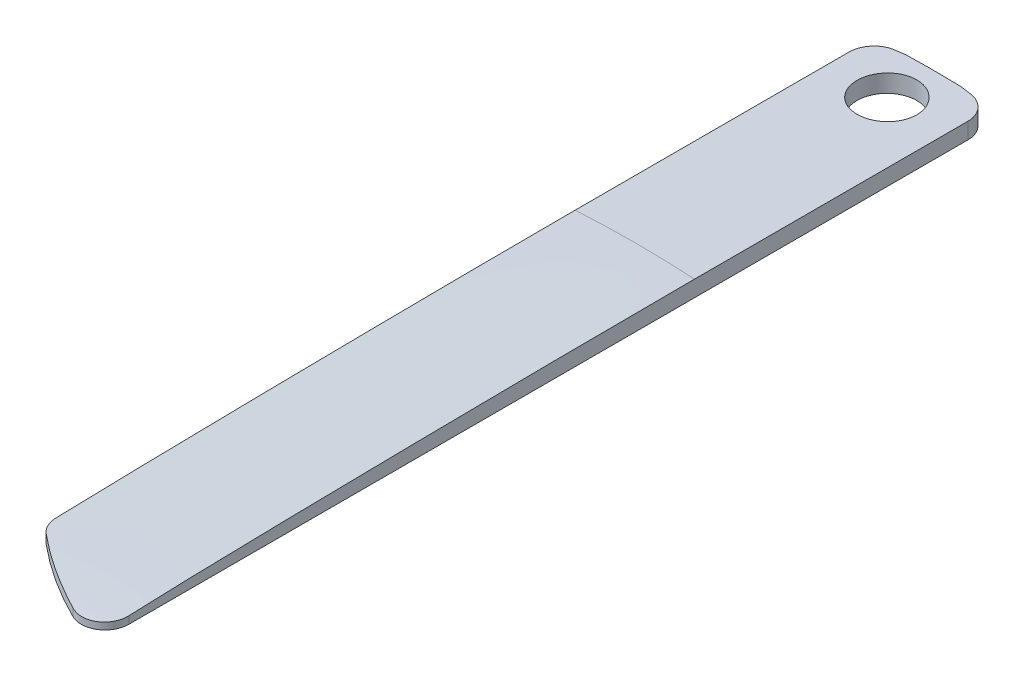
ISO-10303-21;
HEADER;
FILE_DESCRIPTION(('STEP AP214'),'2;1');
FILE_NAME('part.step','',(''),(''),'','','');
FILE_SCHEMA(('AUTOMOTIVE_DESIGN { 1 0 10303 214 1 1 1 1 }'));
ENDSEC;
DATA;
#1=APPLICATION_CONTEXT('core data for automotive mechanical design processes');
#2=APPLICATION_PROTOCOL_DEFINITION('international standard','automotive_design',2000,#1);
#3=PRODUCT_CONTEXT('',#1,'mechanical');
#4=PRODUCT('Part','Part','',(#3));
#5=PRODUCT_RELATED_PRODUCT_CATEGORY('part','',(#4));
#6=PRODUCT_DEFINITION_FORMATION('','',#4);
#7=PRODUCT_DEFINITION_CONTEXT('part definition',#1,'design');
#8=PRODUCT_DEFINITION('design','',#6,#7);
#9=PRODUCT_DEFINITION_SHAPE('','',#8);
#10=(LENGTH_UNIT() NAMED_UNIT(*) SI_UNIT(.MILLI.,.METRE.));
#11=(NAMED_UNIT(*) PLANE_ANGLE_UNIT() SI_UNIT($,.RADIAN.));
#12=(NAMED_UNIT(*) SI_UNIT($,.STERADIAN.) SOLID_ANGLE_UNIT());
#13=UNCERTAINTY_MEASURE_WITH_UNIT(LENGTH_MEASURE(1.E-05),#10,'distance_accuracy_value','');
#14=(GEOMETRIC_REPRESENTATION_CONTEXT(3) GLOBAL_UNCERTAINTY_ASSIGNED_CONTEXT((#13)) GLOBAL_UNIT_ASSIGNED_CONTEXT((#10,
#11,#12)) REPRESENTATION_CONTEXT('',''));
#15=CARTESIAN_POINT('',(0.,0.,0.));
#16=DIRECTION('',(0.,0.,1.));
#17=DIRECTION('',(1.,0.,0.));
#18=AXIS2_PLACEMENT_3D('',#15,#16,#17);
#19=CARTESIAN_POINT('',(-5.,1.,0.));
#20=DIRECTION('',(0.,1.,0.));
#21=DIRECTION('',(0.,0.,1.));
#22=AXIS2_PLACEMENT_3D('',#19,#20,#21);
#23=PLANE('',#22);
#24=CARTESIAN_POINT('',(3.00000000000001,1.,47.4704140906356));
#25=DIRECTION('',(0.,1.,0.));
#26=DIRECTION('',(0.,0.,1.));
#27=AXIS2_PLACEMENT_3D('',#24,#25,#26);
#28=CIRCLE('',#27,2.);
#29=CARTESIAN_POINT('',(5.00000000000001,1.,47.4704140906356));
#30=VERTEX_POINT('',#29);
#31=CARTESIAN_POINT('',(2.12078459872326,1.,49.2667938606614));
#32=VERTEX_POINT('',#31);
#33=EDGE_CURVE('E135',#30,#32,#28,.F.);
#34=ORIENTED_EDGE('',*,*,#33,.T.);
#35=CARTESIAN_POINT('',(16.1882310191513,1.,20.5247175402494));
#36=DIRECTION('',(0.,1.,0.));
#37=DIRECTION('',(0.,0.,1.));
#38=AXIS2_PLACEMENT_3D('',#35,#36,#37);
#39=CIRCLE('',#38,32.);
#40=CARTESIAN_POINT('',(-4.27921540127676,1.,45.123165398334));
#41=VERTEX_POINT('',#40);
#42=EDGE_CURVE('E137',#41,#32,#39,.T.);
#43=ORIENTED_EDGE('',*,*,#42,.F.);
#44=CARTESIAN_POINT('',(-3.00000000000001,1.,43.5857624072037));
#45=DIRECTION('',(0.,1.,0.));
#46=DIRECTION('',(0.,0.,1.));
#47=AXIS2_PLACEMENT_3D('',#44,#45,#46);
#48=CIRCLE('',#47,2.);
#49=CARTESIAN_POINT('',(-5.00000000000001,1.,43.5857624072037));
#50=VERTEX_POINT('',#49);
#51=EDGE_CURVE('E49',#41,#50,#48,.F.);
#52=ORIENTED_EDGE('',*,*,#51,.T.);
#53=DIRECTION('',(0.,0.,1.));
#54=VECTOR('',#53,1.);
#55=CARTESIAN_POINT('',(-5.,1.,-24.8932111423819));
#56=LINE('',#55,#54);
#57=CARTESIAN_POINT('',(-5.,1.,-22.8035085019828));
#58=VERTEX_POINT('',#57);
#59=EDGE_CURVE('E55',#58,#50,#56,.T.);
#60=ORIENTED_EDGE('',*,*,#59,.F.);
#61=CARTESIAN_POINT('',(-3.,1.,-22.8035085019828));
#62=DIRECTION('',(0.,1.,0.));
#63=DIRECTION('',(0.,0.,1.));
#64=AXIS2_PLACEMENT_3D('',#61,#62,#63);
#65=CIRCLE('',#64,2.);
#66=CARTESIAN_POINT('',(-3.26086956521739,1.,-24.7864222847639));
#67=VERTEX_POINT('',#66);
#68=EDGE_CURVE('E207',#58,#67,#65,.F.);
#69=ORIENTED_EDGE('',*,*,#68,.T.);
#70=CARTESIAN_POINT('',(0.,1.,0.));
#71=DIRECTION('',(0.,1.,0.));
#72=DIRECTION('',(0.,0.,1.));
#73=AXIS2_PLACEMENT_3D('',#70,#71,#72);
#74=CIRCLE('',#73,25.);
#75=CARTESIAN_POINT('',(-2.30825453986155,1.,-24.8932111423819));
#76=VERTEX_POINT('',#75);
#77=EDGE_CURVE('E210',#76,#67,#74,.T.);
#78=ORIENTED_EDGE('',*,*,#77,.F.);
#79=DIRECTION('',(1.,0.,0.));
#80=VECTOR('',#79,1.);
#81=CARTESIAN_POINT('',(0.,1.,-24.8932111423819));
#82=LINE('',#81,#80);
#83=CARTESIAN_POINT('',(2.30825453986164,1.,-24.8932111423819));
#84=VERTEX_POINT('',#83);
#85=EDGE_CURVE('E143',#76,#84,#82,.T.);
#86=ORIENTED_EDGE('',*,*,#85,.T.);
#87=CARTESIAN_POINT('',(0.,1.,0.));
#88=DIRECTION('',(0.,1.,0.));
#89=DIRECTION('',(0.,0.,1.));
#90=AXIS2_PLACEMENT_3D('',#87,#88,#89);
#91=CIRCLE('',#90,25.);
#92=CARTESIAN_POINT('',(3.26086956521739,1.,-24.7864222847639));
#93=VERTEX_POINT('',#92);
#94=EDGE_CURVE('E203',#93,#84,#91,.T.);
#95=ORIENTED_EDGE('',*,*,#94,.F.);
#96=CARTESIAN_POINT('',(3.,1.,-22.8035085019828));
#97=DIRECTION('',(0.,1.,0.));
#98=DIRECTION('',(0.,0.,1.));
#99=AXIS2_PLACEMENT_3D('',#96,#97,#98);
#100=CIRCLE('',#99,2.);
#101=CARTESIAN_POINT('',(5.,1.,-22.8035085019828));
#102=VERTEX_POINT('',#101);
#103=EDGE_CURVE('E68',#93,#102,#100,.F.);
#104=ORIENTED_EDGE('',*,*,#103,.T.);
#105=DIRECTION('',(0.,0.,1.));
#106=VECTOR('',#105,1.);
#107=CARTESIAN_POINT('',(5.,1.,-24.8932111423819));
#108=LINE('',#107,#106);
#109=EDGE_CURVE('E11',#102,#30,#108,.T.);
#110=ORIENTED_EDGE('',*,*,#109,.T.);
#111=EDGE_LOOP('',(#34,#43,#52,#60,#69,#78,#86,#95,#104,#110));
#112=FACE_BOUND('',#111,.T.);
#113=CARTESIAN_POINT('',(0.,1.,-21.));
#114=DIRECTION('',(0.,1.,0.));
#115=DIRECTION('',(0.,0.,1.));
#116=AXIS2_PLACEMENT_3D('',#113,#114,#115);
#117=CIRCLE('',#116,2.5);
#118=CARTESIAN_POINT('',(0.,1.,-18.5));
#119=VERTEX_POINT('',#118);
#120=EDGE_CURVE('E214',#119,#119,#117,.T.);
#121=ORIENTED_EDGE('',*,*,#120,.T.);
#122=EDGE_LOOP('',(#121));
#123=FACE_BOUND('',#122,.T.);
#124=ADVANCED_FACE('F44',(#112,#123),#23,.F.);
#125=CARTESIAN_POINT('',(16.1882310191513,2.5,20.5247175402494));
#126=DIRECTION('',(0.,-1.,0.));
#127=DIRECTION('',(0.,0.,-1.));
#128=AXIS2_PLACEMENT_3D('',#125,#126,#127);
#129=CYLINDRICAL_SURFACE('',#128,32.);
#130=DIRECTION('',(0.,-1.,0.));
#131=VECTOR('',#130,1.);
#132=CARTESIAN_POINT('',(-4.27921540127676,2.5,45.123165398334));
#133=LINE('',#132,#131);
#134=CARTESIAN_POINT('',(-4.27921540127676,1.75836287009214,45.123165398334));
#135=VERTEX_POINT('',#134);
#136=EDGE_CURVE('E132',#135,#41,#133,.T.);
#137=ORIENTED_EDGE('',*,*,#136,.T.);
#138=ORIENTED_EDGE('',*,*,#42,.T.);
#139=DIRECTION('',(0.,-1.,0.));
#140=VECTOR('',#139,1.);
#141=CARTESIAN_POINT('',(2.12078459872326,2.5,49.2667938606614));
#142=LINE('',#141,#140);
#143=CARTESIAN_POINT('',(2.12078459872327,1.63257861555496,49.2667938606614));
#144=VERTEX_POINT('',#143);
#145=EDGE_CURVE('E151',#32,#144,#142,.F.);
#146=ORIENTED_EDGE('',*,*,#145,.T.);
#147=CARTESIAN_POINT('',(-4.27921540127676,1.75836287009214,45.123165398334));
#148=CARTESIAN_POINT('',(-3.95180063333138,1.76567310399807,45.3956029963143));
#149=CARTESIAN_POINT('',(-3.6189100957035,1.7712082310094,45.6615179891268));
#150=CARTESIAN_POINT('',(-2.9424502332957,1.7782078956104,46.180101423668));
#151=CARTESIAN_POINT('',(-2.59887157709789,1.77966876917331,46.4327577415204));
#152=CARTESIAN_POINT('',(-1.90175868338306,1.77798418083318,46.9242299833483));
#153=CARTESIAN_POINT('',(-1.5482204929,1.77483686392632,47.1630402934475));
#154=CARTESIAN_POINT('',(-0.834923897698562,1.76335921879306,47.6243680845399));
#155=CARTESIAN_POINT('',(-0.475242358582847,1.7550725077941,47.8470052412647));
#156=CARTESIAN_POINT('',(0.0704919604790495,1.7381455849348,48.170027612442));
#157=CARTESIAN_POINT('',(0.2534100725439,1.73175513213823,48.2758640431516));
#158=CARTESIAN_POINT('',(0.621265083615057,1.71731070992492,48.4838701141943));
#159=CARTESIAN_POINT('',(0.806202029431081,1.7092567018582,48.5860396692688));
#160=CARTESIAN_POINT('',(1.17789385960771,1.69124390139991,48.786606255942));
#161=CARTESIAN_POINT('',(1.36464776137014,1.68128608954571,48.8850051983797));
#162=CARTESIAN_POINT('',(1.73995078950827,1.65904865967811,49.078031138539));
#163=CARTESIAN_POINT('',(1.92849978946269,1.64676920403645,49.1726583994853));
#164=CARTESIAN_POINT('',(2.11883357763895,1.63272272954681,49.265838896476));
#165=CARTESIAN_POINT('',(2.11980907744889,1.63265069507864,49.2663164041053));
#166=CARTESIAN_POINT('',(2.12078459872327,1.63257861555496,49.2667938606614));
#167=B_SPLINE_CURVE_WITH_KNOTS('',3,(#147,#148,#149,#150,#151,#152,#153,#154,#155,#156,#157,
#158,#159,#160,#161,#162,#163,#164,#165,#166),.UNSPECIFIED.,.F.,.F.,(4,2,2,2,2,2,2,2,2,4),(0.,
1.27792287035641,2.55699462261817,3.83658140033607,5.1054543875391,5.73969546087214,
6.37395127141278,7.00788128983442,7.64176698868261,7.64503244751067),.UNSPECIFIED.);
#168=EDGE_CURVE('E148',#135,#144,#167,.T.);
#169=ORIENTED_EDGE('',*,*,#168,.F.);
#170=EDGE_LOOP('',(#137,#138,#146,#169));
#171=FACE_BOUND('',#170,.T.);
#172=ADVANCED_FACE('F146',(#171),#129,.T.);
#173=CARTESIAN_POINT('',(0.,2.5,0.));
#174=DIRECTION('',(0.,-1.,0.));
#175=DIRECTION('',(0.,0.,-1.));
#176=AXIS2_PLACEMENT_3D('',#173,#174,#175);
#177=CYLINDRICAL_SURFACE('',#176,25.);
#178=DIRECTION('',(0.,-1.,0.));
#179=VECTOR('',#178,1.);
#180=CARTESIAN_POINT('',(3.26086956521739,2.5,-24.7864222847639));
#181=LINE('',#180,#179);
#182=CARTESIAN_POINT('',(3.26086956521739,2.43742832037382,-24.7864222847639));
#183=VERTEX_POINT('',#182);
#184=EDGE_CURVE('E187',#183,#93,#181,.T.);
#185=ORIENTED_EDGE('',*,*,#184,.T.);
#186=ORIENTED_EDGE('',*,*,#94,.T.);
#187=DIRECTION('',(0.,-1.,0.));
#188=VECTOR('',#187,1.);
#189=CARTESIAN_POINT('',(2.30825453986155,2.5,-24.8932111423819));
#190=LINE('',#189,#188);
#191=CARTESIAN_POINT('',(2.30825453986164,2.46865281372424,-24.8932111423819));
#192=VERTEX_POINT('',#191);
#193=EDGE_CURVE('E168',#192,#84,#190,.T.);
#194=ORIENTED_EDGE('',*,*,#193,.F.);
#195=CARTESIAN_POINT('',(3.26086956521738,2.43742832037382,-24.7864222847639));
#196=CARTESIAN_POINT('',(3.10247009935233,2.44351140642509,-24.807261382743));
#197=CARTESIAN_POINT('',(2.94388578097348,2.44915499056326,-24.8265800032007));
#198=CARTESIAN_POINT('',(2.62634743918824,2.4595631550134,-24.8621762890734));
#199=CARTESIAN_POINT('',(2.46739341578183,2.46432773532537,-24.8784539544883));
#200=CARTESIAN_POINT('',(2.30825453986164,2.46865281372423,-24.8932111423819));
#201=B_SPLINE_CURVE_WITH_KNOTS('',3,(#195,#196,#197,#198,#199,#200),.UNSPECIFIED.,.F.,.F.,(4,2,
4),(0.,0.479568979987204,0.959137959974391),.UNSPECIFIED.);
#202=EDGE_CURVE('E320',#183,#192,#201,.T.);
#203=ORIENTED_EDGE('',*,*,#202,.F.);
#204=EDGE_LOOP('',(#185,#186,#194,#203));
#205=FACE_BOUND('',#204,.T.);
#206=ADVANCED_FACE('F287',(#205),#177,.T.);
#207=CARTESIAN_POINT('',(-3.,2.5,-22.8035085019828));
#208=DIRECTION('',(0.,-1.,0.));
#209=DIRECTION('',(0.,0.,-1.));
#210=AXIS2_PLACEMENT_3D('',#207,#208,#209);
#211=CYLINDRICAL_SURFACE('',#210,2.);
#212=ORIENTED_EDGE('',*,*,#68,.F.);
#213=DIRECTION('',(0.,-1.,0.));
#214=VECTOR('',#213,1.);
#215=CARTESIAN_POINT('',(-5.,2.5,-22.8035085019828));
#216=LINE('',#215,#214);
#217=CARTESIAN_POINT('',(-5.,2.3528137423857,-22.8035085019828));
#218=VERTEX_POINT('',#217);
#219=EDGE_CURVE('E158',#218,#58,#216,.T.);
#220=ORIENTED_EDGE('',*,*,#219,.F.);
#221=CARTESIAN_POINT('',(-5.,2.3528137423857,-22.8035085019828));
#222=CARTESIAN_POINT('',(-4.99999967769444,2.35281343915907,-22.8597131711831));
#223=CARTESIAN_POINT('',(-4.99762928565556,2.35295347418442,-22.9158908783525));
#224=CARTESIAN_POINT('',(-4.98817318450295,2.3535100121334,-23.0278436163073));
#225=CARTESIAN_POINT('',(-4.98108772281702,2.35392650054985,-23.0836186680671));
#226=CARTESIAN_POINT('',(-4.95282638431271,2.35558255141287,-23.2496447180278));
#227=CARTESIAN_POINT('',(-4.92464536670244,2.3572287273698,-23.3587823941932));
#228=CARTESIAN_POINT('',(-4.85039266803672,2.36150515726594,-23.5707654622275));
#229=CARTESIAN_POINT('',(-4.80431261391739,2.36413587174542,-23.6736078831107));
#230=CARTESIAN_POINT('',(-4.69558656388687,2.37022103891722,-23.8700830092456));
#231=CARTESIAN_POINT('',(-4.63294477949912,2.37367528217045,-23.9637180475723));
#232=CARTESIAN_POINT('',(-4.492817238515,2.38120820449433,-24.1392179898032));
#233=CARTESIAN_POINT('',(-4.41531959315608,2.38528738315609,-24.2210733742761));
#234=CARTESIAN_POINT('',(-4.24765875521781,2.39384209429195,-24.3706624296404));
#235=CARTESIAN_POINT('',(-4.15748896532882,2.39831783276967,-24.4383886987781));
#236=CARTESIAN_POINT('',(-3.96690041801519,2.40743677282998,-24.5578715603161));
#237=CARTESIAN_POINT('',(-3.86646117233685,2.41208029674074,-24.609595365705));
#238=CARTESIAN_POINT('',(-3.65841148328766,2.42129772924322,-24.695362078688));
#239=CARTESIAN_POINT('',(-3.55081383413235,2.42587174499386,-24.7294356229312));
#240=CARTESIAN_POINT('',(-3.41144534522877,2.43151914911871,-24.7609696250469));
#241=CARTESIAN_POINT('',(-3.38147175215599,2.432717849995,-24.7670301343648));
#242=CARTESIAN_POINT('',(-3.32132269855624,2.43509118564863,-24.7777628880984));
#243=CARTESIAN_POINT('',(-3.29114761001123,2.43626585394999,-24.7824372094413));
#244=CARTESIAN_POINT('',(-3.26086956521739,2.43742832037381,-24.7864222847639));
#245=B_SPLINE_CURVE_WITH_KNOTS('',3,(#221,#222,#223,#224,#225,#226,#227,#228,#229,#230,#231,
#232,#233,#234,#235,#236,#237,#238,#239,#240,#241,#242,#243,#244),.UNSPECIFIED.,.F.,.F.,(4,2,2,
2,2,2,2,2,2,2,2,4),(0.,0.168510327890075,0.337011813736477,0.673464536754965,1.01007484029212,
1.34659962855285,1.6833948618026,2.02036608979238,2.35802322534841,2.69509228788658,
2.7868829861894,2.8785354513463),.UNSPECIFIED.);
#246=CARTESIAN_POINT('',(-3.26086956521739,2.43742832037382,-24.7864222847639));
#247=VERTEX_POINT('',#246);
#248=EDGE_CURVE('E351',#218,#247,#245,.T.);
#249=ORIENTED_EDGE('',*,*,#248,.T.);
#250=DIRECTION('',(0.,-1.,0.));
#251=VECTOR('',#250,1.);
#252=CARTESIAN_POINT('',(-3.26086956521739,2.5,-24.7864222847639));
#253=LINE('',#252,#251);
#254=EDGE_CURVE('E184',#67,#247,#253,.F.);
#255=ORIENTED_EDGE('',*,*,#254,.F.);
#256=EDGE_LOOP('',(#212,#220,#249,#255));
#257=FACE_BOUND('',#256,.T.);
#258=ADVANCED_FACE('F293',(#257),#211,.T.);
#259=CARTESIAN_POINT('',(0.,-82.5,71.7951473116016));
#260=DIRECTION('',(0.,0.,-1.));
#261=DIRECTION('',(-1.,0.,0.));
#262=AXIS2_PLACEMENT_3D('',#259,#260,#261);
#263=CYLINDRICAL_SURFACE('',#262,85.);
#264=CARTESIAN_POINT('',(0.,2.5,-23.5));
#265=CARTESIAN_POINT('',(-0.140393524378718,2.4999995046087,-23.4999937841003));
#266=CARTESIAN_POINT('',(-0.280888074295992,2.49964843891319,-23.4881340996054));
#267=CARTESIAN_POINT('',(-0.558005647093423,2.49828171748725,-23.4409892913322));
#268=CARTESIAN_POINT('',(-0.6946238404061,2.4972652676845,-23.4056761773938));
#269=CARTESIAN_POINT('',(-0.95993400401729,2.49468288969539,-23.3126326671837));
#270=CARTESIAN_POINT('',(-1.08862981263495,2.49311723009836,-23.254913227187));
#271=CARTESIAN_POINT('',(-1.33446931951485,2.48961304149571,-23.1187111960275));
#272=CARTESIAN_POINT('',(-1.45161583025469,2.48767460360977,-23.0402336770882));
#273=CARTESIAN_POINT('',(-1.67111944140127,2.48364216613613,-22.8647022282896));
#274=CARTESIAN_POINT('',(-1.7734709848132,2.48154810854245,-22.7676413501677));
#275=CARTESIAN_POINT('',(-1.96043256823564,2.47744095729956,-22.5577103991347));
#276=CARTESIAN_POINT('',(-2.04504190204468,2.47542786687571,-22.444839697236));
#277=CARTESIAN_POINT('',(-2.19412564280933,2.47170938036891,-22.2064729073285));
#278=CARTESIAN_POINT('',(-2.25859676954662,2.47000403443212,-22.0809747668924));
#279=CARTESIAN_POINT('',(-2.3655526214457,2.46709386485658,-21.820930175471));
#280=CARTESIAN_POINT('',(-2.40803743309319,2.465889039249,-21.6863837600806));
#281=CARTESIAN_POINT('',(-2.46980287379754,2.46411618035475,-21.4121033550716));
#282=CARTESIAN_POINT('',(-2.48909025786776,2.46354796169358,-21.2723708878379));
#283=CARTESIAN_POINT('',(-2.50393415065727,2.46311182801535,-20.9916504292447));
#284=CARTESIAN_POINT('',(-2.4994907520903,2.46324391026228,-20.8506624427926));
#285=CARTESIAN_POINT('',(-2.46700493241114,2.46419331109801,-20.5714789086865));
#286=CARTESIAN_POINT('',(-2.43896981673904,2.46501041756108,-20.43328251015));
#287=CARTESIAN_POINT('',(-2.36010767528186,2.46723742037347,-20.1635584733523));
#288=CARTESIAN_POINT('',(-2.30928060033578,2.4686473180014,-20.032030849476));
#289=CARTESIAN_POINT('',(-2.18626895522428,2.47190121055803,-19.7793544758949));
#290=CARTESIAN_POINT('',(-2.11408103649144,2.47374527353806,-19.658207357301));
#291=CARTESIAN_POINT('',(-1.95039935241673,2.47765954321458,-19.4297488298107));
#292=CARTESIAN_POINT('',(-1.85890554498097,2.47972975040414,-19.3224374510822));
#293=CARTESIAN_POINT('',(-1.65916792957406,2.48386387779281,-19.1246540178099));
#294=CARTESIAN_POINT('',(-1.55091778578673,2.48592779531144,-19.0341883615028));
#295=CARTESIAN_POINT('',(-1.32076268672099,2.48981591911872,-18.872713635295));
#296=CARTESIAN_POINT('',(-1.19885772924849,2.49164012536884,-18.8017045685205));
#297=CARTESIAN_POINT('',(-0.944849909762428,2.49484321244864,-18.6811594407829));
#298=CARTESIAN_POINT('',(-0.812746952496885,2.4962220891182,-18.6316235804136));
#299=CARTESIAN_POINT('',(-0.542094676929894,2.49837901386234,-18.5554350986089));
#300=CARTESIAN_POINT('',(-0.40354537550673,2.49915706350996,-18.5287824172627));
#301=CARTESIAN_POINT('',(-0.12398893895488,2.50002442732397,-18.4991247085231));
#302=CARTESIAN_POINT('',(0.0170172562401721,2.50011399932431,-18.4961108284216));
#303=CARTESIAN_POINT('',(0.297533629735387,2.49959499378026,-18.5137932065561));
#304=CARTESIAN_POINT('',(0.437043809699055,2.49898641701226,-18.5344894384248));
#305=CARTESIAN_POINT('',(0.710583265267392,2.49713986854046,-18.5989972206533));
#306=CARTESIAN_POINT('',(0.844613489435592,2.49590200626664,-18.6428047521094));
#307=CARTESIAN_POINT('',(1.10341750203545,2.49293637808399,-18.7522875119779));
#308=CARTESIAN_POINT('',(1.22819127264489,2.49120861123193,-18.8179627824926));
#309=CARTESIAN_POINT('',(1.46498123802067,2.48745717315987,-18.9693395272444));
#310=CARTESIAN_POINT('',(1.5769936224216,2.48543341397062,-19.0550469596066));
#311=CARTESIAN_POINT('',(1.78504291778981,2.48131836506352,-19.2440463538795));
#312=CARTESIAN_POINT('',(1.88107978927006,2.47922707517877,-19.3473383592531));
#313=CARTESIAN_POINT('',(2.05448146308617,2.47521198907131,-19.5686127386144));
#314=CARTESIAN_POINT('',(2.13184055281937,2.47328824420698,-19.6865995903403));
#315=CARTESIAN_POINT('',(2.26565165005375,2.46982595095152,-19.9338915683921));
#316=CARTESIAN_POINT('',(2.32210370368156,2.46828740171055,-20.0631966697462));
#317=CARTESIAN_POINT('',(2.41248825841416,2.46576933485919,-20.3294331323827));
#318=CARTESIAN_POINT('',(2.446424457618,2.46478972544987,-20.4663632372958));
#319=CARTESIAN_POINT('',(2.49082610452918,2.46349972900634,-20.7439805801934));
#320=CARTESIAN_POINT('',(2.50129157044439,2.46318934145297,-20.8846678152633));
#321=CARTESIAN_POINT('',(2.49845424187916,2.46327281736618,-21.1657486001041));
#322=CARTESIAN_POINT('',(2.4851604596561,2.46366641380058,-21.3061422410174));
#323=CARTESIAN_POINT('',(2.4352005252155,2.46511292567582,-21.582704077844));
#324=CARTESIAN_POINT('',(2.39853432663588,2.46616584242451,-21.7188722653749));
#325=CARTESIAN_POINT('',(2.30287157861963,2.46881225953517,-21.9831214226391));
#326=CARTESIAN_POINT('',(2.24387465356549,2.47040576899022,-22.1112022562955));
#327=CARTESIAN_POINT('',(2.10522837096703,2.47395366349275,-22.3556384118559));
#328=CARTESIAN_POINT('',(2.02557976276147,2.47590803544572,-22.4719941589876));
#329=CARTESIAN_POINT('',(1.84786492977961,2.47995807750223,-22.6897183857987));
#330=CARTESIAN_POINT('',(1.74979368738696,2.48205378600049,-22.7910827689327));
#331=CARTESIAN_POINT('',(1.53799721863,2.486150390389,-22.9759360733266));
#332=CARTESIAN_POINT('',(1.42426812157842,2.48815126267041,-23.0594205615197));
#333=CARTESIAN_POINT('',(1.18434076631099,2.49183332276256,-23.2061579091563));
#334=CARTESIAN_POINT('',(1.05813455489749,2.49351430464529,-23.2693977539498));
#335=CARTESIAN_POINT('',(0.796988637653372,2.49636338844887,-23.3737173662836));
#336=CARTESIAN_POINT('',(0.662059564889556,2.49753210177964,-23.41482356455));
#337=CARTESIAN_POINT('',(0.438564897759316,2.49891253358713,-23.4628131108167));
#338=CARTESIAN_POINT('',(0.351450023475594,2.49931856455643,-23.4767406530866));
#339=CARTESIAN_POINT('',(0.176236704864157,2.49986245322686,-23.4953360475219));
#340=CARTESIAN_POINT('',(0.0881382608146914,2.50000031100386,-23.5000039023067));
#341=CARTESIAN_POINT('',(0.,2.5,-23.5));
#342=B_SPLINE_CURVE_WITH_KNOTS('',3,(#264,#265,#266,#267,#268,#269,#270,#271,#272,#273,#274,
#275,#276,#277,#278,#279,#280,#281,#282,#283,#284,#285,#286,#287,#288,#289,#290,#291,#292,#293,
#294,#295,#296,#297,#298,#299,#300,#301,#302,#303,#304,#305,#306,#307,#308,#309,#310,#311,#312,
#313,#314,#315,#316,#317,#318,#319,#320,#321,#322,#323,#324,#325,#326,#327,#328,#329,#330,#331,
#332,#333,#334,#335,#336,#337,#338,#339,#340,#341),.UNSPECIFIED.,.T.,.F.,(4,2,2,2,2,2,2,2,2,2,2,
2,2,2,2,2,2,2,2,2,2,2,2,2,2,2,2,2,2,2,2,2,2,2,2,2,2,2,4),(0.,0.420858857472668,
0.842220887644196,1.26337713865912,1.68443057532394,2.10564175114649,2.52686968945313,
2.94816620387192,3.36946106106012,3.7906332088689,4.21180371120218,4.63284384133271,
5.05388487962772,5.47499195613254,5.89609995081405,6.31736756330548,6.7386352434875,
7.15990685889558,7.58117737136181,8.00229011089398,8.42340238211803,8.8444414488,
9.26548132612255,9.68664659219761,10.1078128992605,10.529107857394,10.9504018860301,
11.3716267024146,11.792851192026,12.2139159384569,12.6349815201246,13.0560541847072,
13.4771115729601,13.8982838077482,14.3195603456484,14.7411071677547,15.1621494802117,
15.426362366124,15.6905751772936),.UNSPECIFIED.);
#343=CARTESIAN_POINT('',(0.,2.5,-23.5));
#344=VERTEX_POINT('',#343);
#345=EDGE_CURVE('E296',#344,#344,#342,.T.);
#346=ORIENTED_EDGE('',*,*,#345,.F.);
#347=EDGE_LOOP('',(#346));
#348=FACE_BOUND('',#347,.T.);
#349=CARTESIAN_POINT('',(0.,-82.5,0.10678885761807));
#350=DIRECTION('',(0.,0.,-1.));
#351=DIRECTION('',(-1.,0.,0.));
#352=AXIS2_PLACEMENT_3D('',#349,#350,#351);
#353=CIRCLE('',#352,85.);
#354=CARTESIAN_POINT('',(-5.,2.3528137423857,0.10678885761807));
#355=VERTEX_POINT('',#354);
#356=CARTESIAN_POINT('',(5.,2.3528137423857,0.10678885761807));
#357=VERTEX_POINT('',#356);
#358=EDGE_CURVE('E327',#355,#357,#353,.T.);
#359=ORIENTED_EDGE('',*,*,#358,.T.);
#360=DIRECTION('',(0.,0.,-1.));
#361=VECTOR('',#360,1.);
#362=CARTESIAN_POINT('',(5.00000000000001,2.3528137423857,71.7951473116016));
#363=LINE('',#362,#361);
#364=CARTESIAN_POINT('',(5.,2.3528137423857,-22.8035085019828));
#365=VERTEX_POINT('',#364);
#366=EDGE_CURVE('E328',#357,#365,#363,.T.);
#367=ORIENTED_EDGE('',*,*,#366,.T.);
#368=CARTESIAN_POINT('',(3.26086956521739,2.43742832037382,-24.7864222847639));
#369=CARTESIAN_POINT('',(3.31670320427218,2.43528508926628,-24.7790764790173));
#370=CARTESIAN_POINT('',(3.37219804766042,2.4330990622343,-24.7693755441104));
#371=CARTESIAN_POINT('',(3.48216777909843,2.428661405253,-24.7453337499082));
#372=CARTESIAN_POINT('',(3.53664271748925,2.42640977855567,-24.7309931202637));
#373=CARTESIAN_POINT('',(3.69786469003354,2.41959324608882,-24.6811675785567));
#374=CARTESIAN_POINT('',(3.8025850902991,2.41495988083726,-24.6388556505953));
#375=CARTESIAN_POINT('',(4.00342707880998,2.40572841729906,-24.5372396748884));
#376=CARTESIAN_POINT('',(4.09954448418605,2.4011303371511,-24.4779274196629));
#377=CARTESIAN_POINT('',(4.28044429377893,2.39220224158901,-24.3440006907116));
#378=CARTESIAN_POINT('',(4.36522979370565,2.38787215313777,-24.2693904103533));
#379=CARTESIAN_POINT('',(4.52105047229964,2.37971610512234,-24.1069922655505));
#380=CARTESIAN_POINT('',(4.59208873860806,2.37589003241755,-24.0192073680197));
#381=CARTESIAN_POINT('',(4.7184519595776,2.36895917346075,-23.8328753997653));
#382=CARTESIAN_POINT('',(4.77376880262992,2.36585475970496,-23.7343228095266));
#383=CARTESIAN_POINT('',(4.86702654196073,2.36055763716806,-23.5293804202654));
#384=CARTESIAN_POINT('',(4.90497715514798,2.35836441861026,-23.4229950426962));
#385=CARTESIAN_POINT('',(4.9624102923944,2.35502534503279,-23.2054496150076));
#386=CARTESIAN_POINT('',(4.98192547803758,2.35387763783618,-23.094298375195));
#387=CARTESIAN_POINT('',(4.9946544305894,2.35312855903324,-22.9526836566499));
#388=CARTESIAN_POINT('',(4.99666004018471,2.35301048027766,-22.9228602892019));
#389=CARTESIAN_POINT('',(4.99933098712826,2.35285318795534,-22.8631978301309));
#390=CARTESIAN_POINT('',(4.99999831491498,2.35281385726604,-22.8333588279822));
#391=CARTESIAN_POINT('',(5.,2.35281374238571,-22.8035085019828));
#392=B_SPLINE_CURVE_WITH_KNOTS('',3,(#368,#369,#370,#371,#372,#373,#374,#375,#376,#377,#378,
#379,#380,#381,#382,#383,#384,#385,#386,#387,#388,#389,#390,#391),.UNSPECIFIED.,.F.,.F.,(4,2,2,
2,2,2,2,2,2,2,2,4),(0.,0.168962733677041,0.33791710549195,0.675298998347853,1.01284404881251,
1.35029669762729,1.68767346608045,2.0252239923782,2.36258541774141,2.69934802116544,
2.78900230437467,2.87852314478024),.UNSPECIFIED.);
#393=EDGE_CURVE('E180',#183,#365,#392,.T.);
#394=ORIENTED_EDGE('',*,*,#393,.F.);
#395=ORIENTED_EDGE('',*,*,#202,.T.);
#396=CARTESIAN_POINT('',(0.,-82.5,-24.8932111423819));
#397=DIRECTION('',(0.,0.,-1.));
#398=DIRECTION('',(-1.,0.,0.));
#399=AXIS2_PLACEMENT_3D('',#396,#397,#398);
#400=CIRCLE('',#399,85.);
#401=CARTESIAN_POINT('',(-2.30825453986164,2.46865281372424,-24.8932111423819));
#402=VERTEX_POINT('',#401);
#403=EDGE_CURVE('E218',#402,#192,#400,.T.);
#404=ORIENTED_EDGE('',*,*,#403,.F.);
#405=CARTESIAN_POINT('',(-2.30825453986164,2.46865281372424,-24.8932111423819));
#406=CARTESIAN_POINT('',(-2.46739341578183,2.46432773532537,-24.8784539544884));
#407=CARTESIAN_POINT('',(-2.62634743918824,2.4595631550134,-24.8621762890734));
#408=CARTESIAN_POINT('',(-2.94388578097349,2.44915499056326,-24.8265800032007));
#409=CARTESIAN_POINT('',(-3.10247009935233,2.44351140642508,-24.807261382743));
#410=CARTESIAN_POINT('',(-3.26086956521739,2.4374283203738,-24.7864222847639));
#411=B_SPLINE_CURVE_WITH_KNOTS('',3,(#405,#406,#407,#408,#409,#410),.UNSPECIFIED.,.F.,.F.,(4,2,
4),(0.,0.479568979987189,0.959137959974396),.UNSPECIFIED.);
#412=EDGE_CURVE('E303',#402,#247,#411,.T.);
#413=ORIENTED_EDGE('',*,*,#412,.T.);
#414=ORIENTED_EDGE('',*,*,#248,.F.);
#415=DIRECTION('',(0.,0.,-1.));
#416=VECTOR('',#415,1.);
#417=CARTESIAN_POINT('',(-5.00000000000001,2.3528137423857,71.7951473116016));
#418=LINE('',#417,#416);
#419=EDGE_CURVE('E311',#218,#355,#418,.F.);
#420=ORIENTED_EDGE('',*,*,#419,.T.);
#421=EDGE_LOOP('',(#359,#367,#394,#395,#404,#413,#414,#420));
#422=FACE_BOUND('',#421,.T.);
#423=ADVANCED_FACE('F233',(#348,#422),#263,.T.);
#424=CARTESIAN_POINT('',(0.,2.5,0.106788857618063));
#425=CARTESIAN_POINT('',(0.,2.49999999999999,15.7269947991637));
#426=CARTESIAN_POINT('',(0.,1.96289421645205,53.2886903458012));
#427=CARTESIAN_POINT('',(0.,1.5,49.4704140906356));
#428=B_SPLINE_CURVE_WITH_KNOTS('',3,(#424,#425,#426,#427),.UNSPECIFIED.,.F.,.F.,(4,4),(0.,1.),.UNSPECIFIED.);
#429=CARTESIAN_POINT('',(0.,-82.5,71.7951473116016));
#430=DIRECTION('',(0.,0.,-1.));
#431=AXIS1_PLACEMENT('',#429,#430);
#432=SURFACE_OF_REVOLUTION('',#428,#431);
#433=CARTESIAN_POINT('',(5.00000000000001,1.62545441427722,47.4704140906356));
#434=CARTESIAN_POINT('',(5.00000057519099,1.62278156461255,47.5266483301833));
#435=CARTESIAN_POINT('',(4.99762713847368,1.62020515510173,47.5828623192892));
#436=CARTESIAN_POINT('',(4.98815750762243,1.61524844253452,47.6948942737288));
#437=CARTESIAN_POINT('',(4.98106176817593,1.61286812062261,47.7507122766672));
#438=CARTESIAN_POINT('',(4.95275754969812,1.60603244434895,47.916883681308));
#439=CARTESIAN_POINT('',(4.92453189472721,1.60187408464966,48.0261307902437));
#440=CARTESIAN_POINT('',(4.85009340799313,1.59435113384006,48.2384057528935));
#441=CARTESIAN_POINT('',(4.80387167515698,1.59098693685677,48.3414304997802));
#442=CARTESIAN_POINT('',(4.72213552099034,1.58650831883322,48.4889517958796));
#443=CARTESIAN_POINT('',(4.69281931298352,1.58510994724622,48.5369607223081));
#444=CARTESIAN_POINT('',(4.63022042540912,1.58249356661584,48.6303909598356));
#445=CARTESIAN_POINT('',(4.59693397545592,1.58127573152196,48.6758097497122));
#446=CARTESIAN_POINT('',(4.49157763970627,1.57788985110218,48.807502140673));
#447=CARTESIAN_POINT('',(4.41390701279393,1.57598387660151,48.8893985828888));
#448=CARTESIAN_POINT('',(4.24589772582019,1.57286825493079,49.0389768787523));
#449=CARTESIAN_POINT('',(4.15555909942448,1.57165860591028,49.1066587701747));
#450=CARTESIAN_POINT('',(4.01257693269689,1.57044855085521,49.1960618416861));
#451=CARTESIAN_POINT('',(3.96364330364738,1.57014593569638,49.2238541203508));
#452=CARTESIAN_POINT('',(3.863659861135,1.56977635335581,49.2751987791089));
#453=CARTESIAN_POINT('',(3.81261211887949,1.56970916080815,49.2987551936109));
#454=CARTESIAN_POINT('',(3.65674883093802,1.56992394464447,49.362839827619));
#455=CARTESIAN_POINT('',(3.54915180282568,1.57062166722449,49.3968217582653));
#456=CARTESIAN_POINT('',(3.33002237683649,1.57365448632563,49.4461920586599));
#457=CARTESIAN_POINT('',(3.21849607490084,1.57598714416688,49.4616080285364));
#458=CARTESIAN_POINT('',(2.99440142609307,1.58272298616494,49.4735504650186));
#459=CARTESIAN_POINT('',(2.88183243105941,1.58712755665602,49.4700642675592));
#460=CARTESIAN_POINT('',(2.65909411485842,1.59773383073046,49.4443330328007));
#461=CARTESIAN_POINT('',(2.54892259966578,1.60393380989974,49.4221059563481));
#462=CARTESIAN_POINT('',(2.33410397004824,1.6173572708806,49.3596037102607));
#463=CARTESIAN_POINT('',(2.22944239174933,1.62457786859313,49.3193787288666));
#464=CARTESIAN_POINT('',(2.12630005963534,1.6321714569314,49.2694855062778));
#465=CARTESIAN_POINT('',(2.12354069001052,1.63237497564539,49.268142831774));
#466=CARTESIAN_POINT('',(2.12078459872326,1.63257861555496,49.2667938606614));
#467=B_SPLINE_CURVE_WITH_KNOTS('',3,(#433,#434,#435,#436,#437,#438,#439,#440,#441,#442,#443,
#444,#445,#446,#447,#448,#449,#450,#451,#452,#453,#454,#455,#456,#457,#458,#459,#460,#461,#462,
#463,#464,#465,#466),.UNSPECIFIED.,.F.,.F.,(4,2,2,2,2,2,2,2,2,2,2,2,2,2,2,2,4),(0.,
0.168793771771523,0.33757129356686,0.674603614731474,1.01180284827558,1.18043630988396,
1.34923121070718,1.68618795286132,2.02314379955697,2.19179599140825,2.36028669129672,
2.69705366240885,3.03331937583751,3.36981040823768,3.7059793211054,4.04121659327311,
4.05044286737867),.UNSPECIFIED.);
#468=CARTESIAN_POINT('',(5.00000000000001,1.62545441427722,47.4704140906356));
#469=VERTEX_POINT('',#468);
#470=EDGE_CURVE('E262',#469,#144,#467,.T.);
#471=ORIENTED_EDGE('',*,*,#470,.F.);
#472=CARTESIAN_POINT('',(5.00000000000001,1.62545441427722,47.4704140906356));
#473=CARTESIAN_POINT('',(5.00000000000001,1.63585477981114,47.2508554887685));
#474=CARTESIAN_POINT('',(5.00000000000001,1.64562492267088,47.0312685010068));
#475=CARTESIAN_POINT('',(5.00000000000001,1.66418414605561,46.5920544051591));
#476=CARTESIAN_POINT('',(5.00000000000001,1.67297323346322,46.3724272973655));
#477=CARTESIAN_POINT('',(5.00000000000001,1.68984973303837,45.9331500198988));
#478=CARTESIAN_POINT('',(5.00000000000001,1.69793715634738,45.7134998506472));
#479=CARTESIAN_POINT('',(5.00000000000001,1.71355250417409,45.2741792305444));
#480=CARTESIAN_POINT('',(5.00000000000001,1.72108042753911,45.0545087796522));
#481=CARTESIAN_POINT('',(5.00000000000001,1.74299091733331,44.3955046448131));
#482=CARTESIAN_POINT('',(5.00000000000001,1.75670130587509,43.9561486497511));
#483=CARTESIAN_POINT('',(5.00000000000001,1.78285052186285,43.0773972759273));
#484=CARTESIAN_POINT('',(5.00000000000001,1.7952893431516,42.6380018969851));
#485=CARTESIAN_POINT('',(5.00000000000001,1.8191907547965,41.7591901212229));
#486=CARTESIAN_POINT('',(5.00000000000001,1.83065335719937,41.3197737247291));
#487=CARTESIAN_POINT('',(5.00000000000001,1.85279563475179,40.4409221338565));
#488=CARTESIAN_POINT('',(5.00000000000001,1.86347531132719,40.0014869395133));
#489=CARTESIAN_POINT('',(5.00000000000001,1.89454822344571,38.683158682417));
#490=CARTESIAN_POINT('',(5.00000000000001,1.91397534411946,37.8042428422764));
#491=CARTESIAN_POINT('',(5.00000000000001,1.95092611074409,36.0464179732686));
#492=CARTESIAN_POINT('',(5.00000000000001,1.96844985673748,35.1675089464736));
#493=CARTESIAN_POINT('',(5.00000000000001,2.00197272947225,33.409654596541));
#494=CARTESIAN_POINT('',(5.00000000000001,2.01797184350437,32.5307092731618));
#495=CARTESIAN_POINT('',(5.00000000000001,2.04868905118869,30.7727913725229));
#496=CARTESIAN_POINT('',(5.00000000000001,2.06340713759224,29.8938187951371));
#497=CARTESIAN_POINT('',(5.00000000000001,2.09171850533661,28.1358539038797));
#498=CARTESIAN_POINT('',(5.00000000000001,2.10531178450927,27.2568615899732));
#499=CARTESIAN_POINT('',(5.00000000000001,2.14011912775599,24.9184873637764));
#500=CARTESIAN_POINT('',(5.00000000000001,2.16043892337609,23.4590920932423));
#501=CARTESIAN_POINT('',(5.00000000000001,2.19851607631273,20.5402756380055));
#502=CARTESIAN_POINT('',(5.00000000000001,2.21627344654348,19.0808544534703));
#503=CARTESIAN_POINT('',(5.00000000000001,2.24923246658666,16.1619885426788));
#504=CARTESIAN_POINT('',(5.00000000000001,2.26443412574944,14.7025438165281));
#505=CARTESIAN_POINT('',(5.00000000000001,2.29206486751825,11.7835433161036));
#506=CARTESIAN_POINT('',(5.00000000000001,2.30449378983155,10.3239875402867));
#507=CARTESIAN_POINT('',(5.00000000000001,2.32059489630626,8.13463258568219));
#508=CARTESIAN_POINT('',(5.00000000000001,2.32553822573411,7.40484270711666));
#509=CARTESIAN_POINT('',(5.00000000000001,2.33442866238251,5.94525715799626));
#510=CARTESIAN_POINT('',(5.00000000000001,2.33837577008632,5.21546148744438));
#511=CARTESIAN_POINT('',(5.00000000000001,2.3450562290857,3.75585588481509));
#512=CARTESIAN_POINT('',(5.00000000000001,2.34778956629163,3.02604595267047));
#513=CARTESIAN_POINT('',(5.00000000000001,2.35069468044424,1.93132728125862));
#514=CARTESIAN_POINT('',(5.,2.35146390335532,1.56642013913166));
#515=CARTESIAN_POINT('',(5.,2.35252079890319,0.836604999433971));
#516=CARTESIAN_POINT('',(5.,2.35280847130721,0.471697001862917));
#517=CARTESIAN_POINT('',(5.,2.3528137423857,0.106788857618063));
#518=B_SPLINE_CURVE_WITH_KNOTS('',3,(#472,#473,#474,#475,#476,#477,#478,#479,#480,#481,#482,
#483,#484,#485,#486,#487,#488,#489,#490,#491,#492,#493,#494,#495,#496,#497,#498,#499,#500,#501,
#502,#503,#504,#505,#506,#507,#508,#509,#510,#511,#512,#513,#514,#515,#516,#517),.UNSPECIFIED.,
.F.,.F.,(4,2,2,2,2,2,2,2,2,2,2,2,2,2,2,2,2,2,2,2,2,2,4),(0.,0.659411376875323,1.31881812734916,
1.97821440541873,2.63761204191832,3.95631866712891,5.27503167750656,6.59372841236424,
7.91242274558964,10.5498111019705,13.1870607684744,15.8243324170076,18.4616189874482,
21.0989106413359,25.4775181895821,29.8561036695771,34.2346731296881,38.6134956506273,
40.8029149824822,42.9923332522644,45.1817769364815,46.276500515329,47.3712246233401),.UNSPECIFIED.);
#519=EDGE_CURVE('E163',#469,#357,#518,.T.);
#520=ORIENTED_EDGE('',*,*,#519,.T.);
#521=ORIENTED_EDGE('',*,*,#358,.F.);
#522=CARTESIAN_POINT('',(-5.00000000000002,2.3528137423857,0.106788857618067));
#523=CARTESIAN_POINT('',(-5.00000000000001,2.35280230528716,0.559721479846979));
#524=CARTESIAN_POINT('',(-5.00000000000001,2.35236302699922,1.01265380329311));
#525=CARTESIAN_POINT('',(-5.,2.35077281642017,1.91851690850641));
#526=CARTESIAN_POINT('',(-5.,2.34962188464773,2.37144769027446));
#527=CARTESIAN_POINT('',(-5.00000000000001,2.34531765628969,3.73023538561407));
#528=CARTESIAN_POINT('',(-5.,2.34131292539933,4.63608956084949));
#529=CARTESIAN_POINT('',(-5.,2.3316255229237,6.44778323214559));
#530=CARTESIAN_POINT('',(-5.00000000000001,2.32594286116642,7.35362272826118));
#531=CARTESIAN_POINT('',(-5.00000000000001,2.31321458879093,9.16529265637102));
#532=CARTESIAN_POINT('',(-5.00000000000001,2.30616897727935,10.0711230883589));
#533=CARTESIAN_POINT('',(-5.00000000000001,2.29090435516351,11.8827457611024));
#534=CARTESIAN_POINT('',(-5.00000000000001,2.28268538115356,12.788538002168));
#535=CARTESIAN_POINT('',(-5.,2.26518268334987,14.6001118968058));
#536=CARTESIAN_POINT('',(-5.,2.2558989598111,15.5058935503805));
#537=CARTESIAN_POINT('',(-5.00000000000001,2.22655362671853,18.2232278774422));
#538=CARTESIAN_POINT('',(-5.00000000000004,2.20499789968566,20.034764684873));
#539=CARTESIAN_POINT('',(-5.00000000000003,2.16578912295752,23.0541351070055));
#540=CARTESIAN_POINT('',(-5.00000000000001,2.1492291898577,24.2619830847832));
#541=CARTESIAN_POINT('',(-5.,2.11423268231573,26.6776499787355));
#542=CARTESIAN_POINT('',(-5.00000000000001,2.09579611108637,27.8854688949563));
#543=CARTESIAN_POINT('',(-5.00000000000001,2.05680022557601,30.3010686947954));
#544=CARTESIAN_POINT('',(-5.00000000000001,2.03624091806376,31.5088495785227));
#545=CARTESIAN_POINT('',(-5.00000000000001,1.99256069552117,33.9244037776291));
#546=CARTESIAN_POINT('',(-5.00000000000001,1.96943969983586,35.132177091572));
#547=CARTESIAN_POINT('',(-5.00000000000001,1.93220725402195,36.9437862544338));
#548=CARTESIAN_POINT('',(-5.00000000000001,1.91937126101862,37.5476483211551));
#549=CARTESIAN_POINT('',(-5.00000000000001,1.89266798920431,38.755349252147));
#550=CARTESIAN_POINT('',(-5.00000000000001,1.87880071125877,39.3591881164367));
#551=CARTESIAN_POINT('',(-5.00000000000001,1.84978149038262,40.5668436314461));
#552=CARTESIAN_POINT('',(-5.,1.8346295297678,41.1706602817455));
#553=CARTESIAN_POINT('',(-5.00000000000001,1.81062500968783,42.0763522980087));
#554=CARTESIAN_POINT('',(-5.00000000000002,1.80241072746711,42.378244564174));
#555=CARTESIAN_POINT('',(-5.,1.78546991396248,42.9820149439035));
#556=CARTESIAN_POINT('',(-4.99999999999998,1.77674338226348,43.2838930574559));
#557=CARTESIAN_POINT('',(-4.99999999999994,1.76771736850721,43.5857624072037));
#558=B_SPLINE_CURVE_WITH_KNOTS('',3,(#522,#523,#524,#525,#526,#527,#528,#529,#530,#531,#532,
#533,#534,#535,#536,#537,#538,#539,#540,#541,#542,#543,#544,#545,#546,#547,#548,#549,#550,#551,
#552,#553,#554,#555,#556,#557),.UNSPECIFIED.,.F.,.F.,(4,2,2,2,2,2,2,2,2,2,2,2,2,2,2,2,2,4),(0.,
1.35879723445621,2.7175934785786,5.43518023195637,8.15275106818661,10.8703236857096,
13.5878115673016,16.3052987981728,21.7402889576443,25.3641723061653,28.9880494507044,
32.6119150401778,36.2358947598272,38.0478895036217,39.8598827268305,41.6719008969597,
42.57791250675,43.4839248507202),.UNSPECIFIED.);
#559=CARTESIAN_POINT('',(-4.99999999999999,1.76771736850721,43.5857624072037));
#560=VERTEX_POINT('',#559);
#561=EDGE_CURVE('E248',#355,#560,#558,.T.);
#562=ORIENTED_EDGE('',*,*,#561,.T.);
#563=CARTESIAN_POINT('',(-4.27921540127676,1.75836287009214,45.123165398334));
#564=CARTESIAN_POINT('',(-4.32240061888572,1.75739774202048,45.0872318037409));
#565=CARTESIAN_POINT('',(-4.36405195897616,1.75653216518221,45.0494946054647));
#566=CARTESIAN_POINT('',(-4.4440359177495,1.75501603161702,44.9706513624851));
#567=CARTESIAN_POINT('',(-4.48236861464584,1.75436546982162,44.929545397221));
#568=CARTESIAN_POINT('',(-4.59192318856814,1.75276146863947,44.8016366985689));
#569=CARTESIAN_POINT('',(-4.65781158742714,1.75215320278503,44.7101514335015));
#570=CARTESIAN_POINT('',(-4.77332483685308,1.7519648048669,44.5174139642165));
#571=CARTESIAN_POINT('',(-4.82293741331647,1.75238544672234,44.4161544630795));
#572=CARTESIAN_POINT('',(-4.90443711615331,1.75431967433327,44.206810731737));
#573=CARTESIAN_POINT('',(-4.93634327963938,1.75583208223019,44.0987339709574));
#574=CARTESIAN_POINT('',(-4.97260921360234,1.75913801966481,43.9225271773932));
#575=CARTESIAN_POINT('',(-4.98287505007283,1.76058234119285,43.8555484612339));
#576=CARTESIAN_POINT('',(-4.99656908796091,1.76386031010011,43.720975556716));
#577=CARTESIAN_POINT('',(-5.00000439253229,1.76569355083888,43.6533820812378));
#578=CARTESIAN_POINT('',(-4.99999999999994,1.76771736850721,43.5857624072037));
#579=B_SPLINE_CURVE_WITH_KNOTS('',3,(#563,#564,#565,#566,#567,#568,#569,#570,#571,#572,#573,
#574,#575,#576,#577,#578),.UNSPECIFIED.,.F.,.F.,(4,2,2,2,2,2,2,4),(0.,0.168460625762013,
0.336917280180686,0.673406209783965,1.01014831592022,1.34652766766811,1.54953846165911,
1.7523380315941),.UNSPECIFIED.);
#580=EDGE_CURVE('E177',#135,#560,#579,.T.);
#581=ORIENTED_EDGE('',*,*,#580,.F.);
#582=ORIENTED_EDGE('',*,*,#168,.T.);
#583=EDGE_LOOP('',(#471,#520,#521,#562,#581,#582));
#584=FACE_BOUND('',#583,.T.);
#585=ADVANCED_FACE('F228',(#584),#432,.F.);
#586=CARTESIAN_POINT('',(-3.00000000000001,2.5,43.5857624072037));
#587=DIRECTION('',(0.,-1.,0.));
#588=DIRECTION('',(0.,0.,-1.));
#589=AXIS2_PLACEMENT_3D('',#586,#587,#588);
#590=CYLINDRICAL_SURFACE('',#589,2.);
#591=ORIENTED_EDGE('',*,*,#51,.F.);
#592=ORIENTED_EDGE('',*,*,#136,.F.);
#593=ORIENTED_EDGE('',*,*,#580,.T.);
#594=DIRECTION('',(0.,-1.,0.));
#595=VECTOR('',#594,1.);
#596=CARTESIAN_POINT('',(-5.00000000000001,2.5,43.5857624072037));
#597=LINE('',#596,#595);
#598=EDGE_CURVE('E133',#50,#560,#597,.F.);
#599=ORIENTED_EDGE('',*,*,#598,.F.);
#600=EDGE_LOOP('',(#591,#592,#593,#599));
#601=FACE_BOUND('',#600,.T.);
#602=ADVANCED_FACE('F129',(#601),#590,.T.);
#603=CARTESIAN_POINT('',(-5.00000000000001,2.5,44.5051025721682));
#604=DIRECTION('',(1.,0.,0.));
#605=DIRECTION('',(0.,0.,-1.));
#606=AXIS2_PLACEMENT_3D('',#603,#604,#605);
#607=PLANE('',#606);
#608=ORIENTED_EDGE('',*,*,#59,.T.);
#609=ORIENTED_EDGE('',*,*,#598,.T.);
#610=ORIENTED_EDGE('',*,*,#561,.F.);
#611=ORIENTED_EDGE('',*,*,#419,.F.);
#612=ORIENTED_EDGE('',*,*,#219,.T.);
#613=EDGE_LOOP('',(#608,#609,#610,#611,#612));
#614=FACE_BOUND('',#613,.T.);
#615=ADVANCED_FACE('F278',(#614),#607,.F.);
#616=DIRECTION('',(0.,-1.,0.));
#617=VECTOR('',#616,1.);
#618=CARTESIAN_POINT('',(-2.30825453986155,2.5,-24.8932111423819));
#619=LINE('',#618,#617);
#620=EDGE_CURVE('E174',#76,#402,#619,.F.);
#621=ORIENTED_EDGE('',*,*,#620,.F.);
#622=ORIENTED_EDGE('',*,*,#77,.T.);
#623=ORIENTED_EDGE('',*,*,#254,.T.);
#624=ORIENTED_EDGE('',*,*,#412,.F.);
#625=EDGE_LOOP('',(#621,#622,#623,#624));
#626=FACE_BOUND('',#625,.T.);
#627=ADVANCED_FACE('F281',(#626),#177,.T.);
#628=CARTESIAN_POINT('',(0.,2.5,-24.8932111423819));
#629=DIRECTION('',(0.,0.,-1.));
#630=DIRECTION('',(-1.,0.,0.));
#631=AXIS2_PLACEMENT_3D('',#628,#629,#630);
#632=PLANE('',#631);
#633=ORIENTED_EDGE('',*,*,#85,.F.);
#634=ORIENTED_EDGE('',*,*,#620,.T.);
#635=ORIENTED_EDGE('',*,*,#403,.T.);
#636=ORIENTED_EDGE('',*,*,#193,.T.);
#637=EDGE_LOOP('',(#633,#634,#635,#636));
#638=FACE_BOUND('',#637,.T.);
#639=ADVANCED_FACE('F340',(#638),#632,.T.);
#640=CARTESIAN_POINT('',(3.,2.5,-22.8035085019828));
#641=DIRECTION('',(0.,-1.,0.));
#642=DIRECTION('',(0.,0.,-1.));
#643=AXIS2_PLACEMENT_3D('',#640,#641,#642);
#644=CYLINDRICAL_SURFACE('',#643,2.);
#645=ORIENTED_EDGE('',*,*,#103,.F.);
#646=ORIENTED_EDGE('',*,*,#184,.F.);
#647=ORIENTED_EDGE('',*,*,#393,.T.);
#648=DIRECTION('',(0.,-1.,0.));
#649=VECTOR('',#648,1.);
#650=CARTESIAN_POINT('',(5.,2.5,-22.8035085019828));
#651=LINE('',#650,#649);
#652=EDGE_CURVE('E156',#102,#365,#651,.F.);
#653=ORIENTED_EDGE('',*,*,#652,.F.);
#654=EDGE_LOOP('',(#645,#646,#647,#653));
#655=FACE_BOUND('',#654,.T.);
#656=ADVANCED_FACE('F276',(#655),#644,.T.);
#657=CARTESIAN_POINT('',(3.00000000000001,2.5,47.4704140906356));
#658=DIRECTION('',(0.,-1.,0.));
#659=DIRECTION('',(0.,0.,-1.));
#660=AXIS2_PLACEMENT_3D('',#657,#658,#659);
#661=CYLINDRICAL_SURFACE('',#660,2.);
#662=ORIENTED_EDGE('',*,*,#33,.F.);
#663=DIRECTION('',(0.,-1.,0.));
#664=VECTOR('',#663,1.);
#665=CARTESIAN_POINT('',(5.00000000000001,2.5,47.4704140906356));
#666=LINE('',#665,#664);
#667=EDGE_CURVE('E150',#469,#30,#666,.T.);
#668=ORIENTED_EDGE('',*,*,#667,.F.);
#669=ORIENTED_EDGE('',*,*,#470,.T.);
#670=ORIENTED_EDGE('',*,*,#145,.F.);
#671=EDGE_LOOP('',(#662,#668,#669,#670));
#672=FACE_BOUND('',#671,.T.);
#673=ADVANCED_FACE('F273',(#672),#661,.T.);
#674=CARTESIAN_POINT('',(5.,2.5,-24.4948974278318));
#675=DIRECTION('',(-1.,0.,0.));
#676=DIRECTION('',(0.,0.,1.));
#677=AXIS2_PLACEMENT_3D('',#674,#675,#676);
#678=PLANE('',#677);
#679=ORIENTED_EDGE('',*,*,#667,.T.);
#680=ORIENTED_EDGE('',*,*,#109,.F.);
#681=ORIENTED_EDGE('',*,*,#652,.T.);
#682=ORIENTED_EDGE('',*,*,#366,.F.);
#683=ORIENTED_EDGE('',*,*,#519,.F.);
#684=EDGE_LOOP('',(#679,#680,#681,#682,#683));
#685=FACE_BOUND('',#684,.T.);
#686=ADVANCED_FACE('F46',(#685),#678,.F.);
#687=CARTESIAN_POINT('',(0.,2.5,-21.));
#688=DIRECTION('',(0.,-1.,0.));
#689=DIRECTION('',(0.,0.,-1.));
#690=AXIS2_PLACEMENT_3D('',#687,#688,#689);
#691=CYLINDRICAL_SURFACE('',#690,2.5);
#692=ORIENTED_EDGE('',*,*,#120,.F.);
#693=EDGE_LOOP('',(#692));
#694=FACE_BOUND('',#693,.T.);
#695=ORIENTED_EDGE('',*,*,#345,.T.);
#696=EDGE_LOOP('',(#695));
#697=FACE_BOUND('',#696,.T.);
#698=ADVANCED_FACE('F288',(#694,#697),#691,.F.);
#699=CLOSED_SHELL('',(#124,#172,#206,#258,#423,#585,#602,#615,#627,#639,#656,#673,#686,#698));
#700=MANIFOLD_SOLID_BREP('B2',#699);
#701=ADVANCED_BREP_SHAPE_REPRESENTATION('',(#18,#700),#14);
#702=SHAPE_DEFINITION_REPRESENTATION(#9,#701);
ENDSEC;
END-ISO-10303-21;
